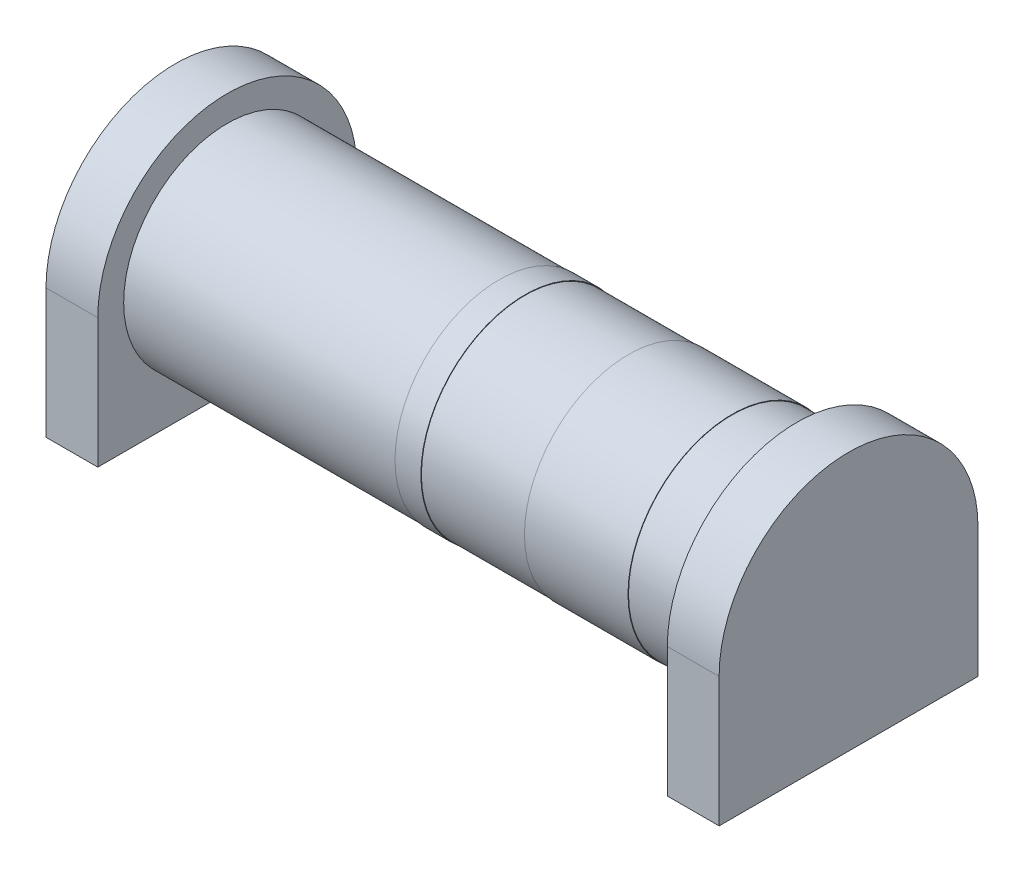
ISO-10303-21;
HEADER;
FILE_DESCRIPTION(('STEP AP214'),'2;1');
FILE_NAME('part.step','',(''),(''),'','','');
FILE_SCHEMA(('AUTOMOTIVE_DESIGN { 1 0 10303 214 1 1 1 1 }'));
ENDSEC;
DATA;
#1=APPLICATION_CONTEXT('core data for automotive mechanical design processes');
#2=APPLICATION_PROTOCOL_DEFINITION('international standard','automotive_design',2000,#1);
#3=PRODUCT_CONTEXT('',#1,'mechanical');
#4=PRODUCT('Part','Part','',(#3));
#5=PRODUCT_RELATED_PRODUCT_CATEGORY('part','',(#4));
#6=PRODUCT_DEFINITION_FORMATION('','',#4);
#7=PRODUCT_DEFINITION_CONTEXT('part definition',#1,'design');
#8=PRODUCT_DEFINITION('design','',#6,#7);
#9=PRODUCT_DEFINITION_SHAPE('','',#8);
#10=(LENGTH_UNIT() NAMED_UNIT(*) SI_UNIT(.MILLI.,.METRE.));
#11=(NAMED_UNIT(*) PLANE_ANGLE_UNIT() SI_UNIT($,.RADIAN.));
#12=(NAMED_UNIT(*) SI_UNIT($,.STERADIAN.) SOLID_ANGLE_UNIT());
#13=UNCERTAINTY_MEASURE_WITH_UNIT(LENGTH_MEASURE(1.E-05),#10,'distance_accuracy_value','');
#14=(GEOMETRIC_REPRESENTATION_CONTEXT(3) GLOBAL_UNCERTAINTY_ASSIGNED_CONTEXT((#13)) GLOBAL_UNIT_ASSIGNED_CONTEXT((#10,
#11,#12)) REPRESENTATION_CONTEXT('',''));
#15=CARTESIAN_POINT('',(0.,0.,0.));
#16=DIRECTION('',(0.,0.,1.));
#17=DIRECTION('',(1.,0.,0.));
#18=AXIS2_PLACEMENT_3D('',#15,#16,#17);
#19=CARTESIAN_POINT('',(1.651,0.,0.));
#20=DIRECTION('',(1.,0.,0.));
#21=DIRECTION('',(0.,0.,-1.));
#22=AXIS2_PLACEMENT_3D('',#19,#20,#21);
#23=PLANE('',#22);
#24=DIRECTION('',(0.,0.,-1.));
#25=VECTOR('',#24,1.);
#26=CARTESIAN_POINT('',(1.651,-0.635,0.));
#27=LINE('',#26,#25);
#28=CARTESIAN_POINT('',(1.651,-0.635,0.635));
#29=VERTEX_POINT('',#28);
#30=CARTESIAN_POINT('',(1.651,-0.635,-0.635));
#31=VERTEX_POINT('',#30);
#32=EDGE_CURVE('E87',#29,#31,#27,.T.);
#33=ORIENTED_EDGE('',*,*,#32,.T.);
#34=DIRECTION('',(0.,1.,0.));
#35=VECTOR('',#34,1.);
#36=CARTESIAN_POINT('',(1.651,0.,-0.635));
#37=LINE('',#36,#35);
#38=CARTESIAN_POINT('',(1.651,0.,-0.635));
#39=VERTEX_POINT('',#38);
#40=EDGE_CURVE('E84',#31,#39,#37,.T.);
#41=ORIENTED_EDGE('',*,*,#40,.T.);
#42=CARTESIAN_POINT('',(1.651,0.,0.));
#43=DIRECTION('',(-1.,0.,0.));
#44=DIRECTION('',(0.,0.,1.));
#45=AXIS2_PLACEMENT_3D('',#42,#43,#44);
#46=CIRCLE('',#45,0.635);
#47=CARTESIAN_POINT('',(1.651,0.,0.635));
#48=VERTEX_POINT('',#47);
#49=EDGE_CURVE('E19',#48,#39,#46,.T.);
#50=ORIENTED_EDGE('',*,*,#49,.F.);
#51=DIRECTION('',(0.,1.,0.));
#52=VECTOR('',#51,1.);
#53=CARTESIAN_POINT('',(1.651,0.,0.635));
#54=LINE('',#53,#52);
#55=EDGE_CURVE('E79',#48,#29,#54,.F.);
#56=ORIENTED_EDGE('',*,*,#55,.T.);
#57=EDGE_LOOP('',(#33,#41,#50,#56));
#58=FACE_BOUND('',#57,.T.);
#59=ADVANCED_FACE('F16',(#58),#23,.T.);
#60=CARTESIAN_POINT('',(-1.35423797468345,0.,0.));
#61=DIRECTION('',(-1.,0.,0.));
#62=DIRECTION('',(0.,0.,1.));
#63=AXIS2_PLACEMENT_3D('',#60,#61,#62);
#64=CYLINDRICAL_SURFACE('',#63,0.635);
#65=DIRECTION('',(1.,0.,0.));
#66=VECTOR('',#65,1.);
#67=CARTESIAN_POINT('',(1.651,0.,0.635));
#68=LINE('',#67,#66);
#69=CARTESIAN_POINT('',(1.397,0.,0.635));
#70=VERTEX_POINT('',#69);
#71=EDGE_CURVE('E96',#70,#48,#68,.T.);
#72=ORIENTED_EDGE('',*,*,#71,.T.);
#73=ORIENTED_EDGE('',*,*,#49,.T.);
#74=DIRECTION('',(1.,0.,0.));
#75=VECTOR('',#74,1.);
#76=CARTESIAN_POINT('',(1.651,0.,-0.635));
#77=LINE('',#76,#75);
#78=CARTESIAN_POINT('',(1.397,0.,-0.635));
#79=VERTEX_POINT('',#78);
#80=EDGE_CURVE('E94',#79,#39,#77,.T.);
#81=ORIENTED_EDGE('',*,*,#80,.F.);
#82=CARTESIAN_POINT('',(1.397,0.,0.));
#83=DIRECTION('',(-1.,0.,0.));
#84=DIRECTION('',(0.,0.,1.));
#85=AXIS2_PLACEMENT_3D('',#82,#83,#84);
#86=CIRCLE('',#85,0.635);
#87=EDGE_CURVE('E152',#70,#79,#86,.T.);
#88=ORIENTED_EDGE('',*,*,#87,.F.);
#89=EDGE_LOOP('',(#72,#73,#81,#88));
#90=FACE_BOUND('',#89,.T.);
#91=ADVANCED_FACE('F93',(#90),#64,.T.);
#92=CARTESIAN_POINT('',(1.651,0.,-0.635));
#93=DIRECTION('',(0.,0.,-1.));
#94=DIRECTION('',(0.,1.,0.));
#95=AXIS2_PLACEMENT_3D('',#92,#93,#94);
#96=PLANE('',#95);
#97=ORIENTED_EDGE('',*,*,#40,.F.);
#98=DIRECTION('',(1.,0.,0.));
#99=VECTOR('',#98,1.);
#100=CARTESIAN_POINT('',(1.651,-0.635,-0.635));
#101=LINE('',#100,#99);
#102=CARTESIAN_POINT('',(1.397,-0.635,-0.635));
#103=VERTEX_POINT('',#102);
#104=EDGE_CURVE('E101',#103,#31,#101,.T.);
#105=ORIENTED_EDGE('',*,*,#104,.F.);
#106=DIRECTION('',(0.,1.,0.));
#107=VECTOR('',#106,1.);
#108=CARTESIAN_POINT('',(1.397,0.,-0.635));
#109=LINE('',#108,#107);
#110=EDGE_CURVE('E99',#79,#103,#109,.F.);
#111=ORIENTED_EDGE('',*,*,#110,.F.);
#112=ORIENTED_EDGE('',*,*,#80,.T.);
#113=EDGE_LOOP('',(#97,#105,#111,#112));
#114=FACE_BOUND('',#113,.T.);
#115=ADVANCED_FACE('F97',(#114),#96,.T.);
#116=CARTESIAN_POINT('',(1.651,-0.635,0.));
#117=DIRECTION('',(0.,-1.,0.));
#118=DIRECTION('',(0.,0.,-1.));
#119=AXIS2_PLACEMENT_3D('',#116,#117,#118);
#120=PLANE('',#119);
#121=ORIENTED_EDGE('',*,*,#32,.F.);
#122=DIRECTION('',(1.,0.,0.));
#123=VECTOR('',#122,1.);
#124=CARTESIAN_POINT('',(1.651,-0.635,0.635));
#125=LINE('',#124,#123);
#126=CARTESIAN_POINT('',(1.397,-0.635,0.635));
#127=VERTEX_POINT('',#126);
#128=EDGE_CURVE('E153',#29,#127,#125,.F.);
#129=ORIENTED_EDGE('',*,*,#128,.T.);
#130=DIRECTION('',(0.,0.,1.));
#131=VECTOR('',#130,1.);
#132=CARTESIAN_POINT('',(1.397,-0.635,0.));
#133=LINE('',#132,#131);
#134=EDGE_CURVE('E156',#103,#127,#133,.T.);
#135=ORIENTED_EDGE('',*,*,#134,.F.);
#136=ORIENTED_EDGE('',*,*,#104,.T.);
#137=EDGE_LOOP('',(#121,#129,#135,#136));
#138=FACE_BOUND('',#137,.T.);
#139=ADVANCED_FACE('F297',(#138),#120,.T.);
#140=CARTESIAN_POINT('',(1.651,0.,0.635));
#141=DIRECTION('',(0.,0.,-1.));
#142=DIRECTION('',(0.,1.,0.));
#143=AXIS2_PLACEMENT_3D('',#140,#141,#142);
#144=PLANE('',#143);
#145=ORIENTED_EDGE('',*,*,#128,.F.);
#146=ORIENTED_EDGE('',*,*,#55,.F.);
#147=ORIENTED_EDGE('',*,*,#71,.F.);
#148=DIRECTION('',(0.,1.,0.));
#149=VECTOR('',#148,1.);
#150=CARTESIAN_POINT('',(1.397,0.,0.635));
#151=LINE('',#150,#149);
#152=EDGE_CURVE('E151',#127,#70,#151,.T.);
#153=ORIENTED_EDGE('',*,*,#152,.F.);
#154=EDGE_LOOP('',(#145,#146,#147,#153));
#155=FACE_BOUND('',#154,.T.);
#156=ADVANCED_FACE('F293',(#155),#144,.F.);
#157=CARTESIAN_POINT('',(1.397,0.,0.));
#158=DIRECTION('',(-1.,0.,0.));
#159=DIRECTION('',(0.,0.,1.));
#160=AXIS2_PLACEMENT_3D('',#157,#158,#159);
#161=PLANE('',#160);
#162=CARTESIAN_POINT('',(1.397,0.,0.));
#163=DIRECTION('',(-1.,0.,0.));
#164=DIRECTION('',(0.,0.,1.));
#165=AXIS2_PLACEMENT_3D('',#162,#163,#164);
#166=CIRCLE('',#165,0.508);
#167=CARTESIAN_POINT('',(1.397,0.,0.508));
#168=VERTEX_POINT('',#167);
#169=EDGE_CURVE('E149',#168,#168,#166,.T.);
#170=ORIENTED_EDGE('',*,*,#169,.F.);
#171=EDGE_LOOP('',(#170));
#172=FACE_BOUND('',#171,.T.);
#173=ORIENTED_EDGE('',*,*,#134,.T.);
#174=ORIENTED_EDGE('',*,*,#152,.T.);
#175=ORIENTED_EDGE('',*,*,#87,.T.);
#176=ORIENTED_EDGE('',*,*,#110,.T.);
#177=EDGE_LOOP('',(#173,#174,#175,#176));
#178=FACE_BOUND('',#177,.T.);
#179=ADVANCED_FACE('F289',(#172,#178),#161,.T.);
#180=CARTESIAN_POINT('',(-1.35423797468345,0.,0.));
#181=DIRECTION('',(-1.,0.,0.));
#182=DIRECTION('',(0.,0.,1.));
#183=AXIS2_PLACEMENT_3D('',#180,#181,#182);
#184=CYLINDRICAL_SURFACE('',#183,0.508);
#185=CARTESIAN_POINT('',(1.0795,0.,0.));
#186=DIRECTION('',(-1.,0.,0.));
#187=DIRECTION('',(0.,0.,1.));
#188=AXIS2_PLACEMENT_3D('',#185,#186,#187);
#189=CIRCLE('',#188,0.508);
#190=CARTESIAN_POINT('',(1.0795,0.,0.508));
#191=VERTEX_POINT('',#190);
#192=EDGE_CURVE('E146',#191,#191,#189,.F.);
#193=ORIENTED_EDGE('',*,*,#192,.T.);
#194=EDGE_LOOP('',(#193));
#195=FACE_BOUND('',#194,.T.);
#196=ORIENTED_EDGE('',*,*,#169,.T.);
#197=EDGE_LOOP('',(#196));
#198=FACE_BOUND('',#197,.T.);
#199=ADVANCED_FACE('F285',(#195,#198),#184,.T.);
#200=CARTESIAN_POINT('',(1.0795,0.,0.));
#201=DIRECTION('',(-1.,0.,0.));
#202=DIRECTION('',(0.,0.,1.));
#203=AXIS2_PLACEMENT_3D('',#200,#201,#202);
#204=PLANE('',#203);
#205=ORIENTED_EDGE('',*,*,#192,.F.);
#206=EDGE_LOOP('',(#205));
#207=FACE_BOUND('',#206,.T.);
#208=CARTESIAN_POINT('',(1.0795,0.,0.));
#209=DIRECTION('',(-1.,0.,0.));
#210=DIRECTION('',(0.,0.,1.));
#211=AXIS2_PLACEMENT_3D('',#208,#209,#210);
#212=CIRCLE('',#211,0.510539999999999);
#213=CARTESIAN_POINT('',(1.0795,0.,0.510539999999999));
#214=VERTEX_POINT('',#213);
#215=EDGE_CURVE('E143',#214,#214,#212,.T.);
#216=ORIENTED_EDGE('',*,*,#215,.F.);
#217=EDGE_LOOP('',(#216));
#218=FACE_BOUND('',#217,.T.);
#219=ADVANCED_FACE('F281',(#207,#218),#204,.F.);
#220=CARTESIAN_POINT('',(-1.35423797468345,0.,0.));
#221=DIRECTION('',(-1.,0.,0.));
#222=DIRECTION('',(0.,0.,1.));
#223=AXIS2_PLACEMENT_3D('',#220,#221,#222);
#224=CYLINDRICAL_SURFACE('',#223,0.510539999999999);
#225=ORIENTED_EDGE('',*,*,#215,.T.);
#226=EDGE_LOOP('',(#225));
#227=FACE_BOUND('',#226,.T.);
#228=CARTESIAN_POINT('',(0.5715,0.,0.));
#229=DIRECTION('',(-1.,0.,0.));
#230=DIRECTION('',(0.,0.,1.));
#231=AXIS2_PLACEMENT_3D('',#228,#229,#230);
#232=CIRCLE('',#231,0.510539999999999);
#233=CARTESIAN_POINT('',(0.5715,0.,0.510539999999999));
#234=VERTEX_POINT('',#233);
#235=EDGE_CURVE('E140',#234,#234,#232,.T.);
#236=ORIENTED_EDGE('',*,*,#235,.F.);
#237=EDGE_LOOP('',(#236));
#238=FACE_BOUND('',#237,.T.);
#239=ADVANCED_FACE('F274',(#227,#238),#224,.T.);
#240=CARTESIAN_POINT('',(0.5715,0.,0.));
#241=DIRECTION('',(-1.,0.,0.));
#242=DIRECTION('',(0.,0.,1.));
#243=AXIS2_PLACEMENT_3D('',#240,#241,#242);
#244=PLANE('',#243);
#245=CARTESIAN_POINT('',(0.5715,0.,0.));
#246=DIRECTION('',(-1.,0.,0.));
#247=DIRECTION('',(0.,0.,1.));
#248=AXIS2_PLACEMENT_3D('',#245,#246,#247);
#249=CIRCLE('',#248,0.508);
#250=CARTESIAN_POINT('',(0.5715,0.,0.508));
#251=VERTEX_POINT('',#250);
#252=EDGE_CURVE('E137',#251,#251,#249,.T.);
#253=ORIENTED_EDGE('',*,*,#252,.F.);
#254=EDGE_LOOP('',(#253));
#255=FACE_BOUND('',#254,.T.);
#256=ORIENTED_EDGE('',*,*,#235,.T.);
#257=EDGE_LOOP('',(#256));
#258=FACE_BOUND('',#257,.T.);
#259=ADVANCED_FACE('F268',(#255,#258),#244,.T.);
#260=CARTESIAN_POINT('',(-1.35423797468345,0.,0.));
#261=DIRECTION('',(-1.,0.,0.));
#262=DIRECTION('',(0.,0.,1.));
#263=AXIS2_PLACEMENT_3D('',#260,#261,#262);
#264=CYLINDRICAL_SURFACE('',#263,0.508);
#265=ORIENTED_EDGE('',*,*,#252,.T.);
#266=EDGE_LOOP('',(#265));
#267=FACE_BOUND('',#266,.T.);
#268=CARTESIAN_POINT('',(0.0635,0.,0.));
#269=DIRECTION('',(-1.,0.,0.));
#270=DIRECTION('',(0.,0.,1.));
#271=AXIS2_PLACEMENT_3D('',#268,#269,#270);
#272=CIRCLE('',#271,0.508);
#273=CARTESIAN_POINT('',(0.0635,0.,0.508));
#274=VERTEX_POINT('',#273);
#275=EDGE_CURVE('E133',#274,#274,#272,.T.);
#276=ORIENTED_EDGE('',*,*,#275,.F.);
#277=EDGE_LOOP('',(#276));
#278=FACE_BOUND('',#277,.T.);
#279=ADVANCED_FACE('F263',(#267,#278),#264,.T.);
#280=CARTESIAN_POINT('',(0.0634999999999999,0.,0.));
#281=DIRECTION('',(1.,0.,0.));
#282=DIRECTION('',(0.,0.,-1.));
#283=AXIS2_PLACEMENT_3D('',#280,#281,#282);
#284=PLANE('',#283);
#285=CARTESIAN_POINT('',(0.0635,0.,0.));
#286=DIRECTION('',(-1.,0.,0.));
#287=DIRECTION('',(0.,0.,1.));
#288=AXIS2_PLACEMENT_3D('',#285,#286,#287);
#289=CIRCLE('',#288,0.510539999999999);
#290=CARTESIAN_POINT('',(0.0635,0.,0.510539999999999));
#291=VERTEX_POINT('',#290);
#292=EDGE_CURVE('E129',#291,#291,#289,.T.);
#293=ORIENTED_EDGE('',*,*,#292,.F.);
#294=EDGE_LOOP('',(#293));
#295=FACE_BOUND('',#294,.T.);
#296=ORIENTED_EDGE('',*,*,#275,.T.);
#297=EDGE_LOOP('',(#296));
#298=FACE_BOUND('',#297,.T.);
#299=ADVANCED_FACE('F260',(#295,#298),#284,.T.);
#300=CARTESIAN_POINT('',(-1.651,0.,0.));
#301=DIRECTION('',(-1.,0.,0.));
#302=DIRECTION('',(0.,0.,1.));
#303=AXIS2_PLACEMENT_3D('',#300,#301,#302);
#304=PLANE('',#303);
#305=DIRECTION('',(0.,0.,1.));
#306=VECTOR('',#305,1.);
#307=CARTESIAN_POINT('',(-1.651,-0.635,0.));
#308=LINE('',#307,#306);
#309=CARTESIAN_POINT('',(-1.651,-0.635,-0.635));
#310=VERTEX_POINT('',#309);
#311=CARTESIAN_POINT('',(-1.651,-0.635,0.635));
#312=VERTEX_POINT('',#311);
#313=EDGE_CURVE('E177',#310,#312,#308,.T.);
#314=ORIENTED_EDGE('',*,*,#313,.T.);
#315=DIRECTION('',(0.,1.,0.));
#316=VECTOR('',#315,1.);
#317=CARTESIAN_POINT('',(-1.651,0.,0.635));
#318=LINE('',#317,#316);
#319=CARTESIAN_POINT('',(-1.651,0.,0.635));
#320=VERTEX_POINT('',#319);
#321=EDGE_CURVE('E132',#312,#320,#318,.T.);
#322=ORIENTED_EDGE('',*,*,#321,.T.);
#323=CARTESIAN_POINT('',(-1.651,0.,0.));
#324=DIRECTION('',(-1.,0.,0.));
#325=DIRECTION('',(0.,0.,1.));
#326=AXIS2_PLACEMENT_3D('',#323,#324,#325);
#327=CIRCLE('',#326,0.635);
#328=CARTESIAN_POINT('',(-1.651,0.,-0.635));
#329=VERTEX_POINT('',#328);
#330=EDGE_CURVE('E125',#329,#320,#327,.F.);
#331=ORIENTED_EDGE('',*,*,#330,.F.);
#332=DIRECTION('',(0.,1.,0.));
#333=VECTOR('',#332,1.);
#334=CARTESIAN_POINT('',(-1.651,0.,-0.635));
#335=LINE('',#334,#333);
#336=EDGE_CURVE('E136',#329,#310,#335,.F.);
#337=ORIENTED_EDGE('',*,*,#336,.T.);
#338=EDGE_LOOP('',(#314,#322,#331,#337));
#339=FACE_BOUND('',#338,.T.);
#340=ADVANCED_FACE('F256',(#339),#304,.T.);
#341=CARTESIAN_POINT('',(-1.35423797468345,0.,0.));
#342=DIRECTION('',(-1.,0.,0.));
#343=DIRECTION('',(0.,0.,1.));
#344=AXIS2_PLACEMENT_3D('',#341,#342,#343);
#345=CYLINDRICAL_SURFACE('',#344,0.510539999999999);
#346=CARTESIAN_POINT('',(-0.0635,0.,0.));
#347=DIRECTION('',(-1.,0.,0.));
#348=DIRECTION('',(0.,0.,1.));
#349=AXIS2_PLACEMENT_3D('',#346,#347,#348);
#350=CIRCLE('',#349,0.510539999999999);
#351=CARTESIAN_POINT('',(-0.0635,0.,0.510539999999999));
#352=VERTEX_POINT('',#351);
#353=EDGE_CURVE('E122',#352,#352,#350,.F.);
#354=ORIENTED_EDGE('',*,*,#353,.T.);
#355=EDGE_LOOP('',(#354));
#356=FACE_BOUND('',#355,.T.);
#357=ORIENTED_EDGE('',*,*,#292,.T.);
#358=EDGE_LOOP('',(#357));
#359=FACE_BOUND('',#358,.T.);
#360=ADVANCED_FACE('F253',(#356,#359),#345,.T.);
#361=CARTESIAN_POINT('',(-1.35423797468345,0.,0.));
#362=DIRECTION('',(-1.,0.,0.));
#363=DIRECTION('',(0.,0.,1.));
#364=AXIS2_PLACEMENT_3D('',#361,#362,#363);
#365=CYLINDRICAL_SURFACE('',#364,0.635);
#366=DIRECTION('',(1.,0.,0.));
#367=VECTOR('',#366,1.);
#368=CARTESIAN_POINT('',(-1.397,0.,0.635));
#369=LINE('',#368,#367);
#370=CARTESIAN_POINT('',(-1.397,0.,0.635));
#371=VERTEX_POINT('',#370);
#372=EDGE_CURVE('E128',#320,#371,#369,.T.);
#373=ORIENTED_EDGE('',*,*,#372,.T.);
#374=CARTESIAN_POINT('',(-1.397,0.,0.));
#375=DIRECTION('',(-1.,0.,0.));
#376=DIRECTION('',(0.,0.,1.));
#377=AXIS2_PLACEMENT_3D('',#374,#375,#376);
#378=CIRCLE('',#377,0.635);
#379=CARTESIAN_POINT('',(-1.397,0.,-0.635));
#380=VERTEX_POINT('',#379);
#381=EDGE_CURVE('E118',#380,#371,#378,.F.);
#382=ORIENTED_EDGE('',*,*,#381,.F.);
#383=DIRECTION('',(1.,0.,0.));
#384=VECTOR('',#383,1.);
#385=CARTESIAN_POINT('',(-1.397,0.,-0.635));
#386=LINE('',#385,#384);
#387=EDGE_CURVE('E193',#329,#380,#386,.T.);
#388=ORIENTED_EDGE('',*,*,#387,.F.);
#389=ORIENTED_EDGE('',*,*,#330,.T.);
#390=EDGE_LOOP('',(#373,#382,#388,#389));
#391=FACE_BOUND('',#390,.T.);
#392=ADVANCED_FACE('F219',(#391),#365,.T.);
#393=CARTESIAN_POINT('',(-1.397,0.,0.635));
#394=DIRECTION('',(0.,0.,-1.));
#395=DIRECTION('',(0.,1.,0.));
#396=AXIS2_PLACEMENT_3D('',#393,#394,#395);
#397=PLANE('',#396);
#398=DIRECTION('',(1.,0.,0.));
#399=VECTOR('',#398,1.);
#400=CARTESIAN_POINT('',(-1.397,-0.635,0.635));
#401=LINE('',#400,#399);
#402=CARTESIAN_POINT('',(-1.397,-0.635,0.635));
#403=VERTEX_POINT('',#402);
#404=EDGE_CURVE('E188',#403,#312,#401,.F.);
#405=ORIENTED_EDGE('',*,*,#404,.F.);
#406=DIRECTION('',(0.,1.,0.));
#407=VECTOR('',#406,1.);
#408=CARTESIAN_POINT('',(-1.397,0.,0.635));
#409=LINE('',#408,#407);
#410=EDGE_CURVE('E121',#371,#403,#409,.F.);
#411=ORIENTED_EDGE('',*,*,#410,.F.);
#412=ORIENTED_EDGE('',*,*,#372,.F.);
#413=ORIENTED_EDGE('',*,*,#321,.F.);
#414=EDGE_LOOP('',(#405,#411,#412,#413));
#415=FACE_BOUND('',#414,.T.);
#416=ADVANCED_FACE('F223',(#415),#397,.F.);
#417=CARTESIAN_POINT('',(-1.397,-0.635,0.));
#418=DIRECTION('',(0.,-1.,0.));
#419=DIRECTION('',(0.,0.,-1.));
#420=AXIS2_PLACEMENT_3D('',#417,#418,#419);
#421=PLANE('',#420);
#422=DIRECTION('',(0.,0.,-1.));
#423=VECTOR('',#422,1.);
#424=CARTESIAN_POINT('',(-1.397,-0.635,0.));
#425=LINE('',#424,#423);
#426=CARTESIAN_POINT('',(-1.397,-0.635,-0.635));
#427=VERTEX_POINT('',#426);
#428=EDGE_CURVE('E196',#403,#427,#425,.T.);
#429=ORIENTED_EDGE('',*,*,#428,.F.);
#430=ORIENTED_EDGE('',*,*,#404,.T.);
#431=ORIENTED_EDGE('',*,*,#313,.F.);
#432=DIRECTION('',(1.,0.,0.));
#433=VECTOR('',#432,1.);
#434=CARTESIAN_POINT('',(-1.397,-0.635,-0.635));
#435=LINE('',#434,#433);
#436=EDGE_CURVE('E34',#427,#310,#435,.F.);
#437=ORIENTED_EDGE('',*,*,#436,.F.);
#438=EDGE_LOOP('',(#429,#430,#431,#437));
#439=FACE_BOUND('',#438,.T.);
#440=ADVANCED_FACE('F224',(#439),#421,.T.);
#441=CARTESIAN_POINT('',(-1.397,0.,-0.635));
#442=DIRECTION('',(0.,0.,-1.));
#443=DIRECTION('',(0.,1.,0.));
#444=AXIS2_PLACEMENT_3D('',#441,#442,#443);
#445=PLANE('',#444);
#446=DIRECTION('',(0.,1.,0.));
#447=VECTOR('',#446,1.);
#448=CARTESIAN_POINT('',(-1.397,0.,-0.635));
#449=LINE('',#448,#447);
#450=EDGE_CURVE('E117',#427,#380,#449,.T.);
#451=ORIENTED_EDGE('',*,*,#450,.F.);
#452=ORIENTED_EDGE('',*,*,#436,.T.);
#453=ORIENTED_EDGE('',*,*,#336,.F.);
#454=ORIENTED_EDGE('',*,*,#387,.T.);
#455=EDGE_LOOP('',(#451,#452,#453,#454));
#456=FACE_BOUND('',#455,.T.);
#457=ADVANCED_FACE('F215',(#456),#445,.T.);
#458=CARTESIAN_POINT('',(-0.0635000000000001,0.,0.));
#459=DIRECTION('',(1.,0.,0.));
#460=DIRECTION('',(0.,0.,-1.));
#461=AXIS2_PLACEMENT_3D('',#458,#459,#460);
#462=PLANE('',#461);
#463=ORIENTED_EDGE('',*,*,#353,.F.);
#464=EDGE_LOOP('',(#463));
#465=FACE_BOUND('',#464,.T.);
#466=CARTESIAN_POINT('',(-0.0635,0.,0.));
#467=DIRECTION('',(-1.,0.,0.));
#468=DIRECTION('',(0.,0.,1.));
#469=AXIS2_PLACEMENT_3D('',#466,#467,#468);
#470=CIRCLE('',#469,0.508);
#471=CARTESIAN_POINT('',(-0.0635,0.,0.508));
#472=VERTEX_POINT('',#471);
#473=EDGE_CURVE('E25',#472,#472,#470,.T.);
#474=ORIENTED_EDGE('',*,*,#473,.F.);
#475=EDGE_LOOP('',(#474));
#476=FACE_BOUND('',#475,.T.);
#477=ADVANCED_FACE('F232',(#465,#476),#462,.F.);
#478=CARTESIAN_POINT('',(-1.397,0.,0.));
#479=DIRECTION('',(1.,0.,0.));
#480=DIRECTION('',(0.,0.,-1.));
#481=AXIS2_PLACEMENT_3D('',#478,#479,#480);
#482=PLANE('',#481);
#483=ORIENTED_EDGE('',*,*,#428,.T.);
#484=ORIENTED_EDGE('',*,*,#450,.T.);
#485=ORIENTED_EDGE('',*,*,#381,.T.);
#486=ORIENTED_EDGE('',*,*,#410,.T.);
#487=EDGE_LOOP('',(#483,#484,#485,#486));
#488=FACE_BOUND('',#487,.T.);
#489=CARTESIAN_POINT('',(-1.397,0.,0.));
#490=DIRECTION('',(-1.,0.,0.));
#491=DIRECTION('',(0.,0.,1.));
#492=AXIS2_PLACEMENT_3D('',#489,#490,#491);
#493=CIRCLE('',#492,0.508);
#494=CARTESIAN_POINT('',(-1.397,0.,0.508));
#495=VERTEX_POINT('',#494);
#496=EDGE_CURVE('E11',#495,#495,#493,.F.);
#497=ORIENTED_EDGE('',*,*,#496,.F.);
#498=EDGE_LOOP('',(#497));
#499=FACE_BOUND('',#498,.T.);
#500=ADVANCED_FACE('F212',(#488,#499),#482,.T.);
#501=CARTESIAN_POINT('',(-1.35423797468345,0.,0.));
#502=DIRECTION('',(-1.,0.,0.));
#503=DIRECTION('',(0.,0.,1.));
#504=AXIS2_PLACEMENT_3D('',#501,#502,#503);
#505=CYLINDRICAL_SURFACE('',#504,0.508);
#506=ORIENTED_EDGE('',*,*,#496,.T.);
#507=EDGE_LOOP('',(#506));
#508=FACE_BOUND('',#507,.T.);
#509=ORIENTED_EDGE('',*,*,#473,.T.);
#510=EDGE_LOOP('',(#509));
#511=FACE_BOUND('',#510,.T.);
#512=ADVANCED_FACE('F235',(#508,#511),#505,.T.);
#513=CLOSED_SHELL('',(#59,#91,#115,#139,#156,#179,#199,#219,#239,#259,#279,#299,#340,#360,#392,
#416,#440,#457,#477,#500,#512));
#514=MANIFOLD_SOLID_BREP('B1',#513);
#515=ADVANCED_BREP_SHAPE_REPRESENTATION('',(#18,#514),#14);
#516=SHAPE_DEFINITION_REPRESENTATION(#9,#515);
ENDSEC;
END-ISO-10303-21;
